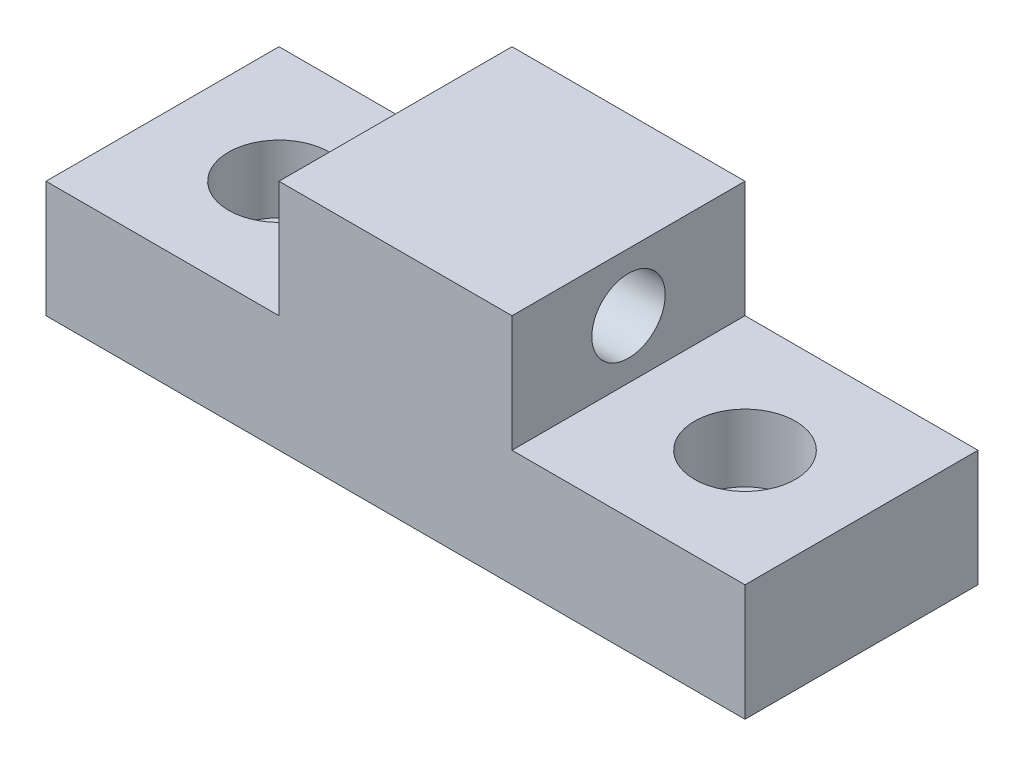
ISO-10303-21;
HEADER;
FILE_DESCRIPTION(('STEP AP214'),'2;1');
FILE_NAME('part.step','',(''),(''),'','','');
FILE_SCHEMA(('AUTOMOTIVE_DESIGN { 1 0 10303 214 1 1 1 1 }'));
ENDSEC;
DATA;
#1=APPLICATION_CONTEXT('core data for automotive mechanical design processes');
#2=APPLICATION_PROTOCOL_DEFINITION('international standard','automotive_design',2000,#1);
#3=PRODUCT_CONTEXT('',#1,'mechanical');
#4=PRODUCT('Part','Part','',(#3));
#5=PRODUCT_RELATED_PRODUCT_CATEGORY('part','',(#4));
#6=PRODUCT_DEFINITION_FORMATION('','',#4);
#7=PRODUCT_DEFINITION_CONTEXT('part definition',#1,'design');
#8=PRODUCT_DEFINITION('design','',#6,#7);
#9=PRODUCT_DEFINITION_SHAPE('','',#8);
#10=(LENGTH_UNIT() NAMED_UNIT(*) SI_UNIT(.MILLI.,.METRE.));
#11=(NAMED_UNIT(*) PLANE_ANGLE_UNIT() SI_UNIT($,.RADIAN.));
#12=(NAMED_UNIT(*) SI_UNIT($,.STERADIAN.) SOLID_ANGLE_UNIT());
#13=UNCERTAINTY_MEASURE_WITH_UNIT(LENGTH_MEASURE(1.E-05),#10,'distance_accuracy_value','');
#14=(GEOMETRIC_REPRESENTATION_CONTEXT(3) GLOBAL_UNCERTAINTY_ASSIGNED_CONTEXT((#13)) GLOBAL_UNIT_ASSIGNED_CONTEXT((#10,
#11,#12)) REPRESENTATION_CONTEXT('',''));
#15=CARTESIAN_POINT('',(0.,0.,0.));
#16=DIRECTION('',(0.,0.,1.));
#17=DIRECTION('',(1.,0.,0.));
#18=AXIS2_PLACEMENT_3D('',#15,#16,#17);
#19=CARTESIAN_POINT('',(-25.4,12.7,0.));
#20=DIRECTION('',(0.,-1.,0.));
#21=DIRECTION('',(0.,0.,-1.));
#22=AXIS2_PLACEMENT_3D('',#19,#20,#21);
#23=CYLINDRICAL_SURFACE('',#22,3.501199875);
#24=CARTESIAN_POINT('',(-25.4,0.,0.));
#25=DIRECTION('',(0.,1.,0.));
#26=DIRECTION('',(0.,0.,1.));
#27=AXIS2_PLACEMENT_3D('',#24,#25,#26);
#28=CIRCLE('',#27,3.501199875);
#29=CARTESIAN_POINT('',(-25.4,0.,3.501199875));
#30=VERTEX_POINT('',#29);
#31=EDGE_CURVE('E160',#30,#30,#28,.T.);
#32=ORIENTED_EDGE('',*,*,#31,.F.);
#33=EDGE_LOOP('',(#32));
#34=FACE_BOUND('',#33,.T.);
#35=CARTESIAN_POINT('',(-25.4,5.35,0.));
#36=DIRECTION('',(0.,1.,0.));
#37=DIRECTION('',(0.,0.,1.));
#38=AXIS2_PLACEMENT_3D('',#35,#36,#37);
#39=CIRCLE('',#38,3.501199875);
#40=CARTESIAN_POINT('',(-25.4,5.35,3.501199875));
#41=VERTEX_POINT('',#40);
#42=EDGE_CURVE('E45',#41,#41,#39,.T.);
#43=ORIENTED_EDGE('',*,*,#42,.T.);
#44=EDGE_LOOP('',(#43));
#45=FACE_BOUND('',#44,.T.);
#46=ADVANCED_FACE('F41',(#34,#45),#23,.F.);
#47=CARTESIAN_POINT('',(25.4,12.7,0.));
#48=DIRECTION('',(0.,-1.,0.));
#49=DIRECTION('',(0.,0.,-1.));
#50=AXIS2_PLACEMENT_3D('',#47,#48,#49);
#51=CYLINDRICAL_SURFACE('',#50,3.501199875);
#52=CARTESIAN_POINT('',(25.4,0.,0.));
#53=DIRECTION('',(0.,1.,0.));
#54=DIRECTION('',(0.,0.,1.));
#55=AXIS2_PLACEMENT_3D('',#52,#53,#54);
#56=CIRCLE('',#55,3.501199875);
#57=CARTESIAN_POINT('',(25.4,0.,3.501199875));
#58=VERTEX_POINT('',#57);
#59=EDGE_CURVE('E163',#58,#58,#56,.F.);
#60=ORIENTED_EDGE('',*,*,#59,.T.);
#61=EDGE_LOOP('',(#60));
#62=FACE_BOUND('',#61,.T.);
#63=CARTESIAN_POINT('',(25.4,5.35,0.));
#64=DIRECTION('',(0.,1.,0.));
#65=DIRECTION('',(0.,0.,1.));
#66=AXIS2_PLACEMENT_3D('',#63,#64,#65);
#67=CIRCLE('',#66,3.501199875);
#68=CARTESIAN_POINT('',(25.4,5.35,3.501199875));
#69=VERTEX_POINT('',#68);
#70=EDGE_CURVE('E169',#69,#69,#67,.F.);
#71=ORIENTED_EDGE('',*,*,#70,.F.);
#72=EDGE_LOOP('',(#71));
#73=FACE_BOUND('',#72,.T.);
#74=ADVANCED_FACE('F222',(#62,#73),#51,.F.);
#75=CARTESIAN_POINT('',(0.,12.7,0.));
#76=DIRECTION('',(0.,1.,0.));
#77=DIRECTION('',(0.,0.,1.));
#78=AXIS2_PLACEMENT_3D('',#75,#76,#77);
#79=PLANE('',#78);
#80=CARTESIAN_POINT('',(25.4,12.7,0.));
#81=DIRECTION('',(0.,1.,0.));
#82=DIRECTION('',(0.,0.,1.));
#83=AXIS2_PLACEMENT_3D('',#80,#81,#82);
#84=CIRCLE('',#83,5.5);
#85=CARTESIAN_POINT('',(25.4,12.7,5.5));
#86=VERTEX_POINT('',#85);
#87=EDGE_CURVE('E182',#86,#86,#84,.T.);
#88=ORIENTED_EDGE('',*,*,#87,.F.);
#89=EDGE_LOOP('',(#88));
#90=FACE_BOUND('',#89,.T.);
#91=DIRECTION('',(0.,0.,-1.));
#92=VECTOR('',#91,1.);
#93=CARTESIAN_POINT('',(12.7,12.7,12.7));
#94=LINE('',#93,#92);
#95=CARTESIAN_POINT('',(12.7,12.7,12.7));
#96=VERTEX_POINT('',#95);
#97=CARTESIAN_POINT('',(12.7,12.7,-12.7));
#98=VERTEX_POINT('',#97);
#99=EDGE_CURVE('E131',#96,#98,#94,.T.);
#100=ORIENTED_EDGE('',*,*,#99,.F.);
#101=DIRECTION('',(1.,0.,0.));
#102=VECTOR('',#101,1.);
#103=CARTESIAN_POINT('',(0.,12.7,12.7));
#104=LINE('',#103,#102);
#105=CARTESIAN_POINT('',(38.1,12.7,12.7));
#106=VERTEX_POINT('',#105);
#107=EDGE_CURVE('E144',#96,#106,#104,.T.);
#108=ORIENTED_EDGE('',*,*,#107,.T.);
#109=DIRECTION('',(0.,0.,-1.));
#110=VECTOR('',#109,1.);
#111=CARTESIAN_POINT('',(38.1,12.7,0.));
#112=LINE('',#111,#110);
#113=CARTESIAN_POINT('',(38.1,12.7,-12.7));
#114=VERTEX_POINT('',#113);
#115=EDGE_CURVE('E143',#106,#114,#112,.T.);
#116=ORIENTED_EDGE('',*,*,#115,.T.);
#117=DIRECTION('',(1.,0.,0.));
#118=VECTOR('',#117,1.);
#119=CARTESIAN_POINT('',(0.,12.7,-12.7));
#120=LINE('',#119,#118);
#121=EDGE_CURVE('E58',#98,#114,#120,.T.);
#122=ORIENTED_EDGE('',*,*,#121,.F.);
#123=EDGE_LOOP('',(#100,#108,#116,#122));
#124=FACE_BOUND('',#123,.T.);
#125=ADVANCED_FACE('F228',(#90,#124),#79,.T.);
#126=CARTESIAN_POINT('',(0.,12.7,12.7));
#127=DIRECTION('',(0.,0.,-1.));
#128=DIRECTION('',(-1.,0.,0.));
#129=AXIS2_PLACEMENT_3D('',#126,#127,#128);
#130=PLANE('',#129);
#131=DIRECTION('',(1.,0.,0.));
#132=VECTOR('',#131,1.);
#133=CARTESIAN_POINT('',(0.,0.,12.7));
#134=LINE('',#133,#132);
#135=CARTESIAN_POINT('',(-38.1,0.,12.7));
#136=VERTEX_POINT('',#135);
#137=CARTESIAN_POINT('',(38.1,0.,12.7));
#138=VERTEX_POINT('',#137);
#139=EDGE_CURVE('E132',#136,#138,#134,.T.);
#140=ORIENTED_EDGE('',*,*,#139,.T.);
#141=DIRECTION('',(0.,-1.,0.));
#142=VECTOR('',#141,1.);
#143=CARTESIAN_POINT('',(38.1,12.7,12.7));
#144=LINE('',#143,#142);
#145=EDGE_CURVE('E11',#106,#138,#144,.T.);
#146=ORIENTED_EDGE('',*,*,#145,.F.);
#147=ORIENTED_EDGE('',*,*,#107,.F.);
#148=DIRECTION('',(0.,-1.,0.));
#149=VECTOR('',#148,1.);
#150=CARTESIAN_POINT('',(12.7,25.4,12.7));
#151=LINE('',#150,#149);
#152=CARTESIAN_POINT('',(12.7,25.4,12.7));
#153=VERTEX_POINT('',#152);
#154=EDGE_CURVE('E197',#153,#96,#151,.T.);
#155=ORIENTED_EDGE('',*,*,#154,.F.);
#156=DIRECTION('',(1.,0.,0.));
#157=VECTOR('',#156,1.);
#158=CARTESIAN_POINT('',(-12.7,25.4,12.7));
#159=LINE('',#158,#157);
#160=CARTESIAN_POINT('',(-12.7,25.4,12.7));
#161=VERTEX_POINT('',#160);
#162=EDGE_CURVE('E125',#161,#153,#159,.T.);
#163=ORIENTED_EDGE('',*,*,#162,.F.);
#164=DIRECTION('',(0.,-1.,0.));
#165=VECTOR('',#164,1.);
#166=CARTESIAN_POINT('',(-12.7,25.4,12.7));
#167=LINE('',#166,#165);
#168=CARTESIAN_POINT('',(-12.7,12.7,12.7));
#169=VERTEX_POINT('',#168);
#170=EDGE_CURVE('E137',#161,#169,#167,.T.);
#171=ORIENTED_EDGE('',*,*,#170,.T.);
#172=CARTESIAN_POINT('',(-38.1,12.7,12.7));
#173=VERTEX_POINT('',#172);
#174=EDGE_CURVE('E141',#173,#169,#104,.T.);
#175=ORIENTED_EDGE('',*,*,#174,.F.);
#176=DIRECTION('',(0.,-1.,0.));
#177=VECTOR('',#176,1.);
#178=CARTESIAN_POINT('',(-38.1,12.7,12.7));
#179=LINE('',#178,#177);
#180=EDGE_CURVE('E150',#173,#136,#179,.T.);
#181=ORIENTED_EDGE('',*,*,#180,.T.);
#182=EDGE_LOOP('',(#140,#146,#147,#155,#163,#171,#175,#181));
#183=FACE_BOUND('',#182,.T.);
#184=ADVANCED_FACE('F43',(#183),#130,.F.);
#185=CARTESIAN_POINT('',(38.1,12.7,0.));
#186=DIRECTION('',(-1.,0.,0.));
#187=DIRECTION('',(0.,0.,1.));
#188=AXIS2_PLACEMENT_3D('',#185,#186,#187);
#189=PLANE('',#188);
#190=DIRECTION('',(0.,0.,-1.));
#191=VECTOR('',#190,1.);
#192=CARTESIAN_POINT('',(38.1,0.,0.));
#193=LINE('',#192,#191);
#194=CARTESIAN_POINT('',(38.1,0.,-12.7));
#195=VERTEX_POINT('',#194);
#196=EDGE_CURVE('E135',#138,#195,#193,.T.);
#197=ORIENTED_EDGE('',*,*,#196,.T.);
#198=DIRECTION('',(0.,-1.,0.));
#199=VECTOR('',#198,1.);
#200=CARTESIAN_POINT('',(38.1,12.7,-12.7));
#201=LINE('',#200,#199);
#202=EDGE_CURVE('E50',#114,#195,#201,.T.);
#203=ORIENTED_EDGE('',*,*,#202,.F.);
#204=ORIENTED_EDGE('',*,*,#115,.F.);
#205=ORIENTED_EDGE('',*,*,#145,.T.);
#206=EDGE_LOOP('',(#197,#203,#204,#205));
#207=FACE_BOUND('',#206,.T.);
#208=ADVANCED_FACE('F241',(#207),#189,.F.);
#209=CARTESIAN_POINT('',(0.,12.7,-12.7));
#210=DIRECTION('',(0.,0.,-1.));
#211=DIRECTION('',(-1.,0.,0.));
#212=AXIS2_PLACEMENT_3D('',#209,#210,#211);
#213=PLANE('',#212);
#214=DIRECTION('',(1.,0.,0.));
#215=VECTOR('',#214,1.);
#216=CARTESIAN_POINT('',(0.,0.,-12.7));
#217=LINE('',#216,#215);
#218=CARTESIAN_POINT('',(-38.1,0.,-12.7));
#219=VERTEX_POINT('',#218);
#220=EDGE_CURVE('E154',#219,#195,#217,.T.);
#221=ORIENTED_EDGE('',*,*,#220,.F.);
#222=DIRECTION('',(0.,-1.,0.));
#223=VECTOR('',#222,1.);
#224=CARTESIAN_POINT('',(-38.1,12.7,-12.7));
#225=LINE('',#224,#223);
#226=CARTESIAN_POINT('',(-38.1,12.7,-12.7));
#227=VERTEX_POINT('',#226);
#228=EDGE_CURVE('E167',#227,#219,#225,.T.);
#229=ORIENTED_EDGE('',*,*,#228,.F.);
#230=CARTESIAN_POINT('',(-12.7,12.7,-12.7));
#231=VERTEX_POINT('',#230);
#232=EDGE_CURVE('E146',#227,#231,#120,.T.);
#233=ORIENTED_EDGE('',*,*,#232,.T.);
#234=DIRECTION('',(0.,-1.,0.));
#235=VECTOR('',#234,1.);
#236=CARTESIAN_POINT('',(-12.7,25.4,-12.7));
#237=LINE('',#236,#235);
#238=CARTESIAN_POINT('',(-12.7,25.4,-12.7));
#239=VERTEX_POINT('',#238);
#240=EDGE_CURVE('E116',#239,#231,#237,.T.);
#241=ORIENTED_EDGE('',*,*,#240,.F.);
#242=DIRECTION('',(-1.,0.,0.));
#243=VECTOR('',#242,1.);
#244=CARTESIAN_POINT('',(-12.7,25.4,-12.7));
#245=LINE('',#244,#243);
#246=CARTESIAN_POINT('',(12.7,25.4,-12.7));
#247=VERTEX_POINT('',#246);
#248=EDGE_CURVE('E108',#247,#239,#245,.T.);
#249=ORIENTED_EDGE('',*,*,#248,.F.);
#250=DIRECTION('',(0.,-1.,0.));
#251=VECTOR('',#250,1.);
#252=CARTESIAN_POINT('',(12.7,25.4,-12.7));
#253=LINE('',#252,#251);
#254=EDGE_CURVE('E113',#247,#98,#253,.T.);
#255=ORIENTED_EDGE('',*,*,#254,.T.);
#256=ORIENTED_EDGE('',*,*,#121,.T.);
#257=ORIENTED_EDGE('',*,*,#202,.T.);
#258=EDGE_LOOP('',(#221,#229,#233,#241,#249,#255,#256,#257));
#259=FACE_BOUND('',#258,.T.);
#260=ADVANCED_FACE('F111',(#259),#213,.T.);
#261=CARTESIAN_POINT('',(-38.1,12.7,0.));
#262=DIRECTION('',(-1.,0.,0.));
#263=DIRECTION('',(0.,0.,1.));
#264=AXIS2_PLACEMENT_3D('',#261,#262,#263);
#265=PLANE('',#264);
#266=DIRECTION('',(0.,0.,-1.));
#267=VECTOR('',#266,1.);
#268=CARTESIAN_POINT('',(-38.1,0.,0.));
#269=LINE('',#268,#267);
#270=EDGE_CURVE('E157',#136,#219,#269,.T.);
#271=ORIENTED_EDGE('',*,*,#270,.F.);
#272=ORIENTED_EDGE('',*,*,#180,.F.);
#273=DIRECTION('',(0.,0.,-1.));
#274=VECTOR('',#273,1.);
#275=CARTESIAN_POINT('',(-38.1,12.7,0.));
#276=LINE('',#275,#274);
#277=EDGE_CURVE('E148',#173,#227,#276,.T.);
#278=ORIENTED_EDGE('',*,*,#277,.T.);
#279=ORIENTED_EDGE('',*,*,#228,.T.);
#280=EDGE_LOOP('',(#271,#272,#278,#279));
#281=FACE_BOUND('',#280,.T.);
#282=ADVANCED_FACE('F235',(#281),#265,.T.);
#283=CARTESIAN_POINT('',(-25.4,12.7,0.));
#284=DIRECTION('',(0.,1.,0.));
#285=DIRECTION('',(0.,0.,1.));
#286=AXIS2_PLACEMENT_3D('',#283,#284,#285);
#287=CIRCLE('',#286,5.5);
#288=CARTESIAN_POINT('',(-25.4,12.7,5.5));
#289=VERTEX_POINT('',#288);
#290=EDGE_CURVE('E177',#289,#289,#287,.T.);
#291=ORIENTED_EDGE('',*,*,#290,.F.);
#292=EDGE_LOOP('',(#291));
#293=FACE_BOUND('',#292,.T.);
#294=DIRECTION('',(0.,0.,1.));
#295=VECTOR('',#294,1.);
#296=CARTESIAN_POINT('',(-12.7,12.7,12.7));
#297=LINE('',#296,#295);
#298=EDGE_CURVE('E66',#231,#169,#297,.T.);
#299=ORIENTED_EDGE('',*,*,#298,.F.);
#300=ORIENTED_EDGE('',*,*,#232,.F.);
#301=ORIENTED_EDGE('',*,*,#277,.F.);
#302=ORIENTED_EDGE('',*,*,#174,.T.);
#303=EDGE_LOOP('',(#299,#300,#301,#302));
#304=FACE_BOUND('',#303,.T.);
#305=ADVANCED_FACE('F238',(#293,#304),#79,.T.);
#306=CARTESIAN_POINT('',(0.,0.,0.));
#307=DIRECTION('',(0.,1.,0.));
#308=DIRECTION('',(0.,0.,1.));
#309=AXIS2_PLACEMENT_3D('',#306,#307,#308);
#310=PLANE('',#309);
#311=ORIENTED_EDGE('',*,*,#139,.F.);
#312=ORIENTED_EDGE('',*,*,#270,.T.);
#313=ORIENTED_EDGE('',*,*,#220,.T.);
#314=ORIENTED_EDGE('',*,*,#196,.F.);
#315=EDGE_LOOP('',(#311,#312,#313,#314));
#316=FACE_BOUND('',#315,.T.);
#317=ORIENTED_EDGE('',*,*,#31,.T.);
#318=EDGE_LOOP('',(#317));
#319=FACE_BOUND('',#318,.T.);
#320=ORIENTED_EDGE('',*,*,#59,.F.);
#321=EDGE_LOOP('',(#320));
#322=FACE_BOUND('',#321,.T.);
#323=ADVANCED_FACE('F217',(#316,#319,#322),#310,.F.);
#324=CARTESIAN_POINT('',(12.7,25.4,12.7));
#325=DIRECTION('',(-1.,0.,0.));
#326=DIRECTION('',(0.,0.,1.));
#327=AXIS2_PLACEMENT_3D('',#324,#325,#326);
#328=PLANE('',#327);
#329=CARTESIAN_POINT('',(12.7,19.05,0.));
#330=DIRECTION('',(-1.,0.,0.));
#331=DIRECTION('',(0.,0.,1.));
#332=AXIS2_PLACEMENT_3D('',#329,#330,#331);
#333=CIRCLE('',#332,4.001199875);
#334=CARTESIAN_POINT('',(12.7,19.05,4.001199875));
#335=VERTEX_POINT('',#334);
#336=EDGE_CURVE('E192',#335,#335,#333,.T.);
#337=ORIENTED_EDGE('',*,*,#336,.T.);
#338=EDGE_LOOP('',(#337));
#339=FACE_BOUND('',#338,.T.);
#340=ORIENTED_EDGE('',*,*,#99,.T.);
#341=ORIENTED_EDGE('',*,*,#254,.F.);
#342=DIRECTION('',(0.,0.,-1.));
#343=VECTOR('',#342,1.);
#344=CARTESIAN_POINT('',(12.7,25.4,12.7));
#345=LINE('',#344,#343);
#346=EDGE_CURVE('E120',#153,#247,#345,.T.);
#347=ORIENTED_EDGE('',*,*,#346,.F.);
#348=ORIENTED_EDGE('',*,*,#154,.T.);
#349=EDGE_LOOP('',(#340,#341,#347,#348));
#350=FACE_BOUND('',#349,.T.);
#351=ADVANCED_FACE('F130',(#339,#350),#328,.F.);
#352=CARTESIAN_POINT('',(-12.7,25.4,12.7));
#353=DIRECTION('',(1.,0.,0.));
#354=DIRECTION('',(0.,0.,-1.));
#355=AXIS2_PLACEMENT_3D('',#352,#353,#354);
#356=PLANE('',#355);
#357=CARTESIAN_POINT('',(-12.7,19.05,0.));
#358=DIRECTION('',(-1.,0.,0.));
#359=DIRECTION('',(0.,0.,1.));
#360=AXIS2_PLACEMENT_3D('',#357,#358,#359);
#361=CIRCLE('',#360,4.001199875);
#362=CARTESIAN_POINT('',(-12.7,19.05,4.001199875));
#363=VERTEX_POINT('',#362);
#364=EDGE_CURVE('E175',#363,#363,#361,.T.);
#365=ORIENTED_EDGE('',*,*,#364,.F.);
#366=EDGE_LOOP('',(#365));
#367=FACE_BOUND('',#366,.T.);
#368=ORIENTED_EDGE('',*,*,#298,.T.);
#369=ORIENTED_EDGE('',*,*,#170,.F.);
#370=DIRECTION('',(0.,0.,1.));
#371=VECTOR('',#370,1.);
#372=CARTESIAN_POINT('',(-12.7,25.4,12.7));
#373=LINE('',#372,#371);
#374=EDGE_CURVE('E119',#239,#161,#373,.T.);
#375=ORIENTED_EDGE('',*,*,#374,.F.);
#376=ORIENTED_EDGE('',*,*,#240,.T.);
#377=EDGE_LOOP('',(#368,#369,#375,#376));
#378=FACE_BOUND('',#377,.T.);
#379=ADVANCED_FACE('F206',(#367,#378),#356,.F.);
#380=CARTESIAN_POINT('',(0.,25.4,0.));
#381=DIRECTION('',(0.,-1.,0.));
#382=DIRECTION('',(0.,0.,-1.));
#383=AXIS2_PLACEMENT_3D('',#380,#381,#382);
#384=PLANE('',#383);
#385=ORIENTED_EDGE('',*,*,#346,.T.);
#386=ORIENTED_EDGE('',*,*,#248,.T.);
#387=ORIENTED_EDGE('',*,*,#374,.T.);
#388=ORIENTED_EDGE('',*,*,#162,.T.);
#389=EDGE_LOOP('',(#385,#386,#387,#388));
#390=FACE_BOUND('',#389,.T.);
#391=ADVANCED_FACE('F123',(#390),#384,.F.);
#392=CARTESIAN_POINT('',(31.,19.05,0.));
#393=DIRECTION('',(-1.,0.,0.));
#394=DIRECTION('',(0.,0.,1.));
#395=AXIS2_PLACEMENT_3D('',#392,#393,#394);
#396=CYLINDRICAL_SURFACE('',#395,4.001199875);
#397=ORIENTED_EDGE('',*,*,#364,.T.);
#398=EDGE_LOOP('',(#397));
#399=FACE_BOUND('',#398,.T.);
#400=ORIENTED_EDGE('',*,*,#336,.F.);
#401=EDGE_LOOP('',(#400));
#402=FACE_BOUND('',#401,.T.);
#403=ADVANCED_FACE('F215',(#399,#402),#396,.F.);
#404=CARTESIAN_POINT('',(-25.4,5.35,0.));
#405=DIRECTION('',(0.,1.,0.));
#406=DIRECTION('',(0.,0.,1.));
#407=AXIS2_PLACEMENT_3D('',#404,#405,#406);
#408=CYLINDRICAL_SURFACE('',#407,5.5);
#409=CARTESIAN_POINT('',(-25.4,5.35,0.));
#410=DIRECTION('',(0.,1.,0.));
#411=DIRECTION('',(0.,0.,1.));
#412=AXIS2_PLACEMENT_3D('',#409,#410,#411);
#413=CIRCLE('',#412,5.5);
#414=CARTESIAN_POINT('',(-25.4,5.35,5.5));
#415=VERTEX_POINT('',#414);
#416=EDGE_CURVE('E171',#415,#415,#413,.T.);
#417=ORIENTED_EDGE('',*,*,#416,.F.);
#418=EDGE_LOOP('',(#417));
#419=FACE_BOUND('',#418,.T.);
#420=ORIENTED_EDGE('',*,*,#290,.T.);
#421=EDGE_LOOP('',(#420));
#422=FACE_BOUND('',#421,.T.);
#423=ADVANCED_FACE('F282',(#419,#422),#408,.F.);
#424=CARTESIAN_POINT('',(-25.4,5.35,0.));
#425=DIRECTION('',(0.,1.,0.));
#426=DIRECTION('',(0.,0.,1.));
#427=AXIS2_PLACEMENT_3D('',#424,#425,#426);
#428=PLANE('',#427);
#429=ORIENTED_EDGE('',*,*,#42,.F.);
#430=EDGE_LOOP('',(#429));
#431=FACE_BOUND('',#430,.T.);
#432=ORIENTED_EDGE('',*,*,#416,.T.);
#433=EDGE_LOOP('',(#432));
#434=FACE_BOUND('',#433,.T.);
#435=ADVANCED_FACE('F277',(#431,#434),#428,.T.);
#436=CARTESIAN_POINT('',(25.4,5.35,0.));
#437=DIRECTION('',(0.,1.,0.));
#438=DIRECTION('',(0.,0.,1.));
#439=AXIS2_PLACEMENT_3D('',#436,#437,#438);
#440=PLANE('',#439);
#441=CARTESIAN_POINT('',(25.4,5.35,0.));
#442=DIRECTION('',(0.,1.,0.));
#443=DIRECTION('',(0.,0.,1.));
#444=AXIS2_PLACEMENT_3D('',#441,#442,#443);
#445=CIRCLE('',#444,5.5);
#446=CARTESIAN_POINT('',(25.4,5.35,5.5));
#447=VERTEX_POINT('',#446);
#448=EDGE_CURVE('E187',#447,#447,#445,.T.);
#449=ORIENTED_EDGE('',*,*,#448,.T.);
#450=EDGE_LOOP('',(#449));
#451=FACE_BOUND('',#450,.T.);
#452=ORIENTED_EDGE('',*,*,#70,.T.);
#453=EDGE_LOOP('',(#452));
#454=FACE_BOUND('',#453,.T.);
#455=ADVANCED_FACE('F271',(#451,#454),#440,.T.);
#456=CARTESIAN_POINT('',(25.4,5.35,0.));
#457=DIRECTION('',(0.,1.,0.));
#458=DIRECTION('',(0.,0.,1.));
#459=AXIS2_PLACEMENT_3D('',#456,#457,#458);
#460=CYLINDRICAL_SURFACE('',#459,5.5);
#461=ORIENTED_EDGE('',*,*,#448,.F.);
#462=EDGE_LOOP('',(#461));
#463=FACE_BOUND('',#462,.T.);
#464=ORIENTED_EDGE('',*,*,#87,.T.);
#465=EDGE_LOOP('',(#464));
#466=FACE_BOUND('',#465,.T.);
#467=ADVANCED_FACE('F269',(#463,#466),#460,.F.);
#468=CLOSED_SHELL('',(#46,#74,#125,#184,#208,#260,#282,#305,#323,#351,#379,#391,#403,#423,#435,
#455,#467));
#469=MANIFOLD_SOLID_BREP('B2',#468);
#470=ADVANCED_BREP_SHAPE_REPRESENTATION('',(#18,#469),#14);
#471=SHAPE_DEFINITION_REPRESENTATION(#9,#470);
ENDSEC;
END-ISO-10303-21;
